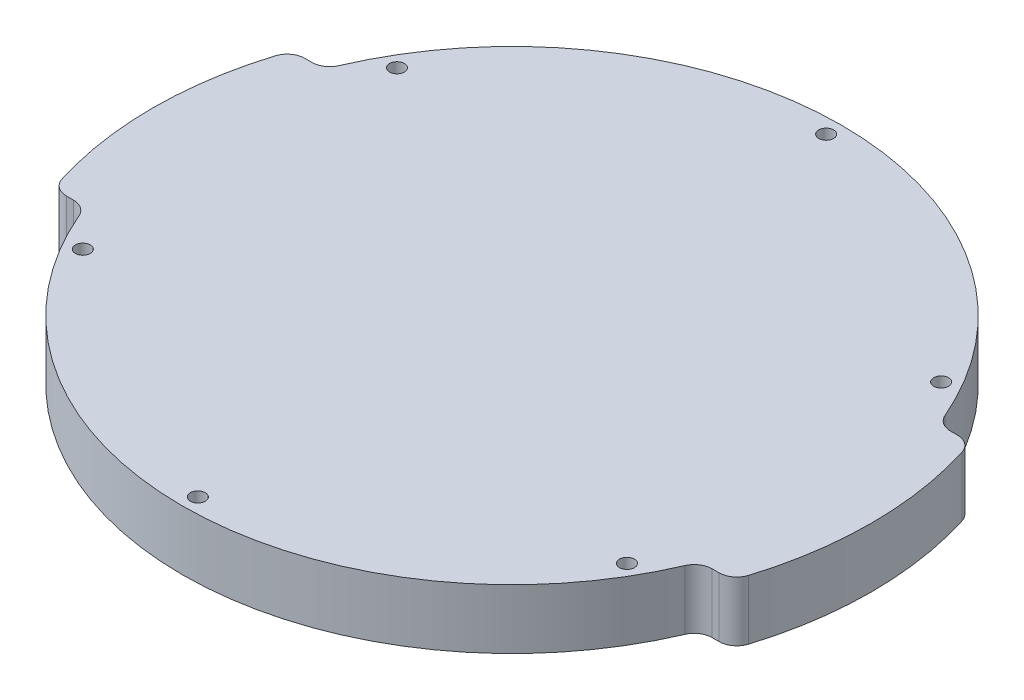
ISO-10303-21;
HEADER;
FILE_DESCRIPTION(('STEP AP214'),'2;1');
FILE_NAME('part.step','',(''),(''),'','','');
FILE_SCHEMA(('AUTOMOTIVE_DESIGN { 1 0 10303 214 1 1 1 1 }'));
ENDSEC;
DATA;
#1=APPLICATION_CONTEXT('core data for automotive mechanical design processes');
#2=APPLICATION_PROTOCOL_DEFINITION('international standard','automotive_design',2000,#1);
#3=PRODUCT_CONTEXT('',#1,'mechanical');
#4=PRODUCT('Part','Part','',(#3));
#5=PRODUCT_RELATED_PRODUCT_CATEGORY('part','',(#4));
#6=PRODUCT_DEFINITION_FORMATION('','',#4);
#7=PRODUCT_DEFINITION_CONTEXT('part definition',#1,'design');
#8=PRODUCT_DEFINITION('design','',#6,#7);
#9=PRODUCT_DEFINITION_SHAPE('','',#8);
#10=(LENGTH_UNIT() NAMED_UNIT(*) SI_UNIT(.MILLI.,.METRE.));
#11=(NAMED_UNIT(*) PLANE_ANGLE_UNIT() SI_UNIT($,.RADIAN.));
#12=(NAMED_UNIT(*) SI_UNIT($,.STERADIAN.) SOLID_ANGLE_UNIT());
#13=UNCERTAINTY_MEASURE_WITH_UNIT(LENGTH_MEASURE(1.E-05),#10,'distance_accuracy_value','');
#14=(GEOMETRIC_REPRESENTATION_CONTEXT(3) GLOBAL_UNCERTAINTY_ASSIGNED_CONTEXT((#13)) GLOBAL_UNIT_ASSIGNED_CONTEXT((#10,
#11,#12)) REPRESENTATION_CONTEXT('',''));
#15=CARTESIAN_POINT('',(0.,0.,0.));
#16=DIRECTION('',(0.,0.,1.));
#17=DIRECTION('',(1.,0.,0.));
#18=AXIS2_PLACEMENT_3D('',#15,#16,#17);
#19=CARTESIAN_POINT('',(0.,10.,0.));
#20=DIRECTION('',(0.,-1.,0.));
#21=DIRECTION('',(0.,0.,-1.));
#22=AXIS2_PLACEMENT_3D('',#19,#20,#21);
#23=CYLINDRICAL_SURFACE('',#22,60.3);
#24=CARTESIAN_POINT('',(0.,0.,0.));
#25=DIRECTION('',(0.,1.,0.));
#26=DIRECTION('',(0.,0.,1.));
#27=AXIS2_PLACEMENT_3D('',#24,#25,#26);
#28=CIRCLE('',#27,60.3);
#29=CARTESIAN_POINT('',(57.5850330094447,0.,17.8900523560209));
#30=VERTEX_POINT('',#29);
#31=CARTESIAN_POINT('',(57.5850330094447,0.,-17.8900523560209));
#32=VERTEX_POINT('',#31);
#33=EDGE_CURVE('E190',#30,#32,#28,.T.);
#34=ORIENTED_EDGE('',*,*,#33,.T.);
#35=DIRECTION('',(0.,-1.,0.));
#36=VECTOR('',#35,1.);
#37=CARTESIAN_POINT('',(57.5850330094447,10.,-17.8900523560209));
#38=LINE('',#37,#36);
#39=CARTESIAN_POINT('',(57.5850330094447,10.,-17.8900523560209));
#40=VERTEX_POINT('',#39);
#41=EDGE_CURVE('E197',#32,#40,#38,.F.);
#42=ORIENTED_EDGE('',*,*,#41,.T.);
#43=CARTESIAN_POINT('',(0.,10.,0.));
#44=DIRECTION('',(0.,1.,0.));
#45=DIRECTION('',(0.,0.,1.));
#46=AXIS2_PLACEMENT_3D('',#43,#44,#45);
#47=CIRCLE('',#46,60.3);
#48=CARTESIAN_POINT('',(57.5850330094447,10.,17.8900523560209));
#49=VERTEX_POINT('',#48);
#50=EDGE_CURVE('E186',#49,#40,#47,.T.);
#51=ORIENTED_EDGE('',*,*,#50,.F.);
#52=DIRECTION('',(0.,-1.,0.));
#53=VECTOR('',#52,1.);
#54=CARTESIAN_POINT('',(57.5850330094447,10.,17.8900523560209));
#55=LINE('',#54,#53);
#56=EDGE_CURVE('E195',#49,#30,#55,.T.);
#57=ORIENTED_EDGE('',*,*,#56,.T.);
#58=EDGE_LOOP('',(#34,#42,#51,#57));
#59=FACE_BOUND('',#58,.T.);
#60=ADVANCED_FACE('F33',(#59),#23,.T.);
#61=CARTESIAN_POINT('',(-57.5850330094447,0.,-17.8900523560209));
#62=VERTEX_POINT('',#61);
#63=CARTESIAN_POINT('',(-57.5850330094446,0.,17.890052356021));
#64=VERTEX_POINT('',#63);
#65=EDGE_CURVE('E187',#62,#64,#28,.T.);
#66=ORIENTED_EDGE('',*,*,#65,.T.);
#67=DIRECTION('',(0.,-1.,0.));
#68=VECTOR('',#67,1.);
#69=CARTESIAN_POINT('',(-57.5850330094447,10.,17.890052356021));
#70=LINE('',#69,#68);
#71=CARTESIAN_POINT('',(-57.5850330094446,10.,17.890052356021));
#72=VERTEX_POINT('',#71);
#73=EDGE_CURVE('E231',#64,#72,#70,.F.);
#74=ORIENTED_EDGE('',*,*,#73,.T.);
#75=CARTESIAN_POINT('',(-57.5850330094447,10.,-17.8900523560209));
#76=VERTEX_POINT('',#75);
#77=EDGE_CURVE('E183',#76,#72,#47,.T.);
#78=ORIENTED_EDGE('',*,*,#77,.F.);
#79=DIRECTION('',(0.,-1.,0.));
#80=VECTOR('',#79,1.);
#81=CARTESIAN_POINT('',(-57.5850330094447,10.,-17.8900523560209));
#82=LINE('',#81,#80);
#83=EDGE_CURVE('E229',#76,#62,#82,.T.);
#84=ORIENTED_EDGE('',*,*,#83,.T.);
#85=EDGE_LOOP('',(#66,#74,#78,#84));
#86=FACE_BOUND('',#85,.T.);
#87=ADVANCED_FACE('F285',(#86),#23,.T.);
#88=CARTESIAN_POINT('',(0.,10.,0.));
#89=DIRECTION('',(0.,1.,0.));
#90=DIRECTION('',(0.,0.,1.));
#91=AXIS2_PLACEMENT_3D('',#88,#89,#90);
#92=PLANE('',#91);
#93=CARTESIAN_POINT('',(45.6395387794396,10.,-26.3500000000005));
#94=DIRECTION('',(0.,-1.,0.));
#95=DIRECTION('',(0.,0.,-1.));
#96=AXIS2_PLACEMENT_3D('',#93,#94,#95);
#97=CIRCLE('',#96,1.25);
#98=CARTESIAN_POINT('',(45.6395387794396,10.,-27.6000000000005));
#99=VERTEX_POINT('',#98);
#100=EDGE_CURVE('E343',#99,#99,#97,.T.);
#101=ORIENTED_EDGE('',*,*,#100,.T.);
#102=EDGE_LOOP('',(#101));
#103=FACE_BOUND('',#102,.T.);
#104=CARTESIAN_POINT('',(45.6395387794402,10.,26.3499999999996));
#105=DIRECTION('',(0.,-1.,0.));
#106=DIRECTION('',(0.,0.,-1.));
#107=AXIS2_PLACEMENT_3D('',#104,#105,#106);
#108=CIRCLE('',#107,1.25);
#109=CARTESIAN_POINT('',(45.6395387794402,10.,25.0999999999996));
#110=VERTEX_POINT('',#109);
#111=EDGE_CURVE('E351',#110,#110,#108,.T.);
#112=ORIENTED_EDGE('',*,*,#111,.T.);
#113=EDGE_LOOP('',(#112));
#114=FACE_BOUND('',#113,.T.);
#115=CARTESIAN_POINT('',(3.68002133114066E-13,10.,52.7));
#116=DIRECTION('',(0.,-1.,0.));
#117=DIRECTION('',(0.,0.,-1.));
#118=AXIS2_PLACEMENT_3D('',#115,#116,#117);
#119=CIRCLE('',#118,1.25);
#120=CARTESIAN_POINT('',(3.68002133114066E-13,10.,51.45));
#121=VERTEX_POINT('',#120);
#122=EDGE_CURVE('E357',#121,#121,#119,.T.);
#123=ORIENTED_EDGE('',*,*,#122,.T.);
#124=EDGE_LOOP('',(#123));
#125=FACE_BOUND('',#124,.T.);
#126=CARTESIAN_POINT('',(-45.6395387794398,10.,26.3500000000002));
#127=DIRECTION('',(0.,-1.,0.));
#128=DIRECTION('',(0.,0.,-1.));
#129=AXIS2_PLACEMENT_3D('',#126,#127,#128);
#130=CIRCLE('',#129,1.25);
#131=CARTESIAN_POINT('',(-45.6395387794398,10.,25.1000000000002));
#132=VERTEX_POINT('',#131);
#133=EDGE_CURVE('E363',#132,#132,#130,.T.);
#134=ORIENTED_EDGE('',*,*,#133,.T.);
#135=EDGE_LOOP('',(#134));
#136=FACE_BOUND('',#135,.T.);
#137=CARTESIAN_POINT('',(-45.63953877944,10.,-26.3499999999999));
#138=DIRECTION('',(0.,-1.,0.));
#139=DIRECTION('',(0.,0.,-1.));
#140=AXIS2_PLACEMENT_3D('',#137,#138,#139);
#141=CIRCLE('',#140,1.25);
#142=CARTESIAN_POINT('',(-45.63953877944,10.,-27.5999999999999));
#143=VERTEX_POINT('',#142);
#144=EDGE_CURVE('E369',#143,#143,#141,.T.);
#145=ORIENTED_EDGE('',*,*,#144,.T.);
#146=EDGE_LOOP('',(#145));
#147=FACE_BOUND('',#146,.T.);
#148=CARTESIAN_POINT('',(0.,10.,-52.7));
#149=DIRECTION('',(0.,-1.,0.));
#150=DIRECTION('',(0.,0.,-1.));
#151=AXIS2_PLACEMENT_3D('',#148,#149,#150);
#152=CIRCLE('',#151,1.25);
#153=CARTESIAN_POINT('',(0.,10.,-53.95));
#154=VERTEX_POINT('',#153);
#155=EDGE_CURVE('E375',#154,#154,#152,.T.);
#156=ORIENTED_EDGE('',*,*,#155,.T.);
#157=EDGE_LOOP('',(#156));
#158=FACE_BOUND('',#157,.T.);
#159=ORIENTED_EDGE('',*,*,#50,.T.);
#160=CARTESIAN_POINT('',(54.7201059940494,10.,-17.));
#161=DIRECTION('',(0.,1.,0.));
#162=DIRECTION('',(0.,0.,1.));
#163=AXIS2_PLACEMENT_3D('',#160,#161,#162);
#164=CIRCLE('',#163,3.);
#165=CARTESIAN_POINT('',(54.7201059940494,10.,-20.));
#166=VERTEX_POINT('',#165);
#167=EDGE_CURVE('E173',#40,#166,#164,.T.);
#168=ORIENTED_EDGE('',*,*,#167,.T.);
#169=DIRECTION('',(1.,0.,0.));
#170=VECTOR('',#169,1.);
#171=CARTESIAN_POINT('',(51.5566678519859,10.,-20.));
#172=LINE('',#171,#170);
#173=CARTESIAN_POINT('',(53.5713542856628,10.,-20.));
#174=VERTEX_POINT('',#173);
#175=EDGE_CURVE('E164',#174,#166,#172,.T.);
#176=ORIENTED_EDGE('',*,*,#175,.F.);
#177=CARTESIAN_POINT('',(53.5713542856628,10.,-23.));
#178=DIRECTION('',(0.,1.,0.));
#179=DIRECTION('',(0.,0.,1.));
#180=AXIS2_PLACEMENT_3D('',#177,#178,#179);
#181=CIRCLE('',#180,3.);
#182=CARTESIAN_POINT('',(50.8146808232788,10.,-21.8164665523156));
#183=VERTEX_POINT('',#182);
#184=EDGE_CURVE('E147',#174,#183,#181,.F.);
#185=ORIENTED_EDGE('',*,*,#184,.T.);
#186=CARTESIAN_POINT('',(0.,10.,0.));
#187=DIRECTION('',(0.,-1.,0.));
#188=DIRECTION('',(0.,0.,1.));
#189=AXIS2_PLACEMENT_3D('',#186,#187,#188);
#190=CIRCLE('',#189,55.3);
#191=CARTESIAN_POINT('',(-50.8146808232788,10.,-21.8164665523156));
#192=VERTEX_POINT('',#191);
#193=EDGE_CURVE('E175',#192,#183,#190,.T.);
#194=ORIENTED_EDGE('',*,*,#193,.F.);
#195=CARTESIAN_POINT('',(-53.5713542856628,10.,-23.));
#196=DIRECTION('',(0.,1.,0.));
#197=DIRECTION('',(0.,0.,1.));
#198=AXIS2_PLACEMENT_3D('',#195,#196,#197);
#199=CIRCLE('',#198,3.);
#200=CARTESIAN_POINT('',(-53.5713542856628,10.,-20.));
#201=VERTEX_POINT('',#200);
#202=EDGE_CURVE('E41',#192,#201,#199,.F.);
#203=ORIENTED_EDGE('',*,*,#202,.T.);
#204=DIRECTION('',(1.,0.,0.));
#205=VECTOR('',#204,1.);
#206=CARTESIAN_POINT('',(-51.5566678519859,10.,-20.));
#207=LINE('',#206,#205);
#208=CARTESIAN_POINT('',(-54.7201059940494,10.,-20.));
#209=VERTEX_POINT('',#208);
#210=EDGE_CURVE('E174',#209,#201,#207,.T.);
#211=ORIENTED_EDGE('',*,*,#210,.F.);
#212=CARTESIAN_POINT('',(-54.7201059940494,10.,-17.));
#213=DIRECTION('',(0.,1.,0.));
#214=DIRECTION('',(0.,0.,1.));
#215=AXIS2_PLACEMENT_3D('',#212,#213,#214);
#216=CIRCLE('',#215,3.);
#217=EDGE_CURVE('E200',#209,#76,#216,.T.);
#218=ORIENTED_EDGE('',*,*,#217,.T.);
#219=ORIENTED_EDGE('',*,*,#77,.T.);
#220=CARTESIAN_POINT('',(-54.7201059940494,10.,17.));
#221=DIRECTION('',(0.,1.,0.));
#222=DIRECTION('',(0.,0.,1.));
#223=AXIS2_PLACEMENT_3D('',#220,#221,#222);
#224=CIRCLE('',#223,3.);
#225=CARTESIAN_POINT('',(-54.7201059940494,10.,20.));
#226=VERTEX_POINT('',#225);
#227=EDGE_CURVE('E202',#72,#226,#224,.T.);
#228=ORIENTED_EDGE('',*,*,#227,.T.);
#229=DIRECTION('',(-1.,0.,0.));
#230=VECTOR('',#229,1.);
#231=CARTESIAN_POINT('',(-56.8866416656846,10.,20.));
#232=LINE('',#231,#230);
#233=CARTESIAN_POINT('',(-53.5713542856628,10.,20.));
#234=VERTEX_POINT('',#233);
#235=EDGE_CURVE('E390',#234,#226,#232,.T.);
#236=ORIENTED_EDGE('',*,*,#235,.F.);
#237=CARTESIAN_POINT('',(-53.5713542856628,10.,23.));
#238=DIRECTION('',(0.,1.,0.));
#239=DIRECTION('',(0.,0.,1.));
#240=AXIS2_PLACEMENT_3D('',#237,#238,#239);
#241=CIRCLE('',#240,3.);
#242=CARTESIAN_POINT('',(-50.8146808232787,10.,21.8164665523156));
#243=VERTEX_POINT('',#242);
#244=EDGE_CURVE('E242',#234,#243,#241,.F.);
#245=ORIENTED_EDGE('',*,*,#244,.T.);
#246=CARTESIAN_POINT('',(0.,10.,0.));
#247=DIRECTION('',(0.,-1.,0.));
#248=DIRECTION('',(0.,0.,1.));
#249=AXIS2_PLACEMENT_3D('',#246,#247,#248);
#250=CIRCLE('',#249,55.3);
#251=CARTESIAN_POINT('',(50.8146808232787,10.,21.8164665523156));
#252=VERTEX_POINT('',#251);
#253=EDGE_CURVE('E378',#252,#243,#250,.T.);
#254=ORIENTED_EDGE('',*,*,#253,.F.);
#255=CARTESIAN_POINT('',(53.5713542856628,10.,23.));
#256=DIRECTION('',(0.,1.,0.));
#257=DIRECTION('',(0.,0.,1.));
#258=AXIS2_PLACEMENT_3D('',#255,#256,#257);
#259=CIRCLE('',#258,3.);
#260=CARTESIAN_POINT('',(53.5713542856628,10.,20.));
#261=VERTEX_POINT('',#260);
#262=EDGE_CURVE('E238',#252,#261,#259,.F.);
#263=ORIENTED_EDGE('',*,*,#262,.T.);
#264=DIRECTION('',(-1.,0.,0.));
#265=VECTOR('',#264,1.);
#266=CARTESIAN_POINT('',(51.5566678519859,10.,20.));
#267=LINE('',#266,#265);
#268=CARTESIAN_POINT('',(54.7201059940494,10.,20.));
#269=VERTEX_POINT('',#268);
#270=EDGE_CURVE('E260',#269,#261,#267,.T.);
#271=ORIENTED_EDGE('',*,*,#270,.F.);
#272=CARTESIAN_POINT('',(54.7201059940494,10.,17.));
#273=DIRECTION('',(0.,1.,0.));
#274=DIRECTION('',(0.,0.,1.));
#275=AXIS2_PLACEMENT_3D('',#272,#273,#274);
#276=CIRCLE('',#275,3.);
#277=EDGE_CURVE('E204',#269,#49,#276,.T.);
#278=ORIENTED_EDGE('',*,*,#277,.T.);
#279=EDGE_LOOP('',(#159,#168,#176,#185,#194,#203,#211,#218,#219,#228,#236,#245,#254,#263,#271,#278));
#280=FACE_BOUND('',#279,.T.);
#281=ADVANCED_FACE('F172',(#103,#114,#125,#136,#147,#158,#280),#92,.T.);
#282=CARTESIAN_POINT('',(0.,0.,0.));
#283=DIRECTION('',(0.,1.,0.));
#284=DIRECTION('',(0.,0.,1.));
#285=AXIS2_PLACEMENT_3D('',#282,#283,#284);
#286=PLANE('',#285);
#287=CARTESIAN_POINT('',(45.6395387794396,0.,-26.3500000000005));
#288=DIRECTION('',(0.,-1.,0.));
#289=DIRECTION('',(0.,0.,-1.));
#290=AXIS2_PLACEMENT_3D('',#287,#288,#289);
#291=CIRCLE('',#290,1.25);
#292=CARTESIAN_POINT('',(45.6395387794396,0.,-27.6000000000005));
#293=VERTEX_POINT('',#292);
#294=EDGE_CURVE('E346',#293,#293,#291,.T.);
#295=ORIENTED_EDGE('',*,*,#294,.F.);
#296=EDGE_LOOP('',(#295));
#297=FACE_BOUND('',#296,.T.);
#298=CARTESIAN_POINT('',(45.6395387794402,0.,26.3499999999996));
#299=DIRECTION('',(0.,-1.,0.));
#300=DIRECTION('',(0.,0.,-1.));
#301=AXIS2_PLACEMENT_3D('',#298,#299,#300);
#302=CIRCLE('',#301,1.25);
#303=CARTESIAN_POINT('',(45.6395387794402,0.,25.0999999999996));
#304=VERTEX_POINT('',#303);
#305=EDGE_CURVE('E348',#304,#304,#302,.T.);
#306=ORIENTED_EDGE('',*,*,#305,.F.);
#307=EDGE_LOOP('',(#306));
#308=FACE_BOUND('',#307,.T.);
#309=CARTESIAN_POINT('',(3.68002133114066E-13,0.,52.7));
#310=DIRECTION('',(0.,-1.,0.));
#311=DIRECTION('',(0.,0.,-1.));
#312=AXIS2_PLACEMENT_3D('',#309,#310,#311);
#313=CIRCLE('',#312,1.25);
#314=CARTESIAN_POINT('',(3.68002133114066E-13,0.,51.45));
#315=VERTEX_POINT('',#314);
#316=EDGE_CURVE('E354',#315,#315,#313,.T.);
#317=ORIENTED_EDGE('',*,*,#316,.F.);
#318=EDGE_LOOP('',(#317));
#319=FACE_BOUND('',#318,.T.);
#320=CARTESIAN_POINT('',(-45.6395387794398,0.,26.3500000000002));
#321=DIRECTION('',(0.,-1.,0.));
#322=DIRECTION('',(0.,0.,-1.));
#323=AXIS2_PLACEMENT_3D('',#320,#321,#322);
#324=CIRCLE('',#323,1.25);
#325=CARTESIAN_POINT('',(-45.6395387794398,0.,25.1000000000002));
#326=VERTEX_POINT('',#325);
#327=EDGE_CURVE('E360',#326,#326,#324,.T.);
#328=ORIENTED_EDGE('',*,*,#327,.F.);
#329=EDGE_LOOP('',(#328));
#330=FACE_BOUND('',#329,.T.);
#331=CARTESIAN_POINT('',(-45.63953877944,0.,-26.3499999999999));
#332=DIRECTION('',(0.,-1.,0.));
#333=DIRECTION('',(0.,0.,-1.));
#334=AXIS2_PLACEMENT_3D('',#331,#332,#333);
#335=CIRCLE('',#334,1.25);
#336=CARTESIAN_POINT('',(-45.63953877944,0.,-27.5999999999999));
#337=VERTEX_POINT('',#336);
#338=EDGE_CURVE('E366',#337,#337,#335,.T.);
#339=ORIENTED_EDGE('',*,*,#338,.F.);
#340=EDGE_LOOP('',(#339));
#341=FACE_BOUND('',#340,.T.);
#342=CARTESIAN_POINT('',(0.,0.,-52.7));
#343=DIRECTION('',(0.,-1.,0.));
#344=DIRECTION('',(0.,0.,-1.));
#345=AXIS2_PLACEMENT_3D('',#342,#343,#344);
#346=CIRCLE('',#345,1.25);
#347=CARTESIAN_POINT('',(0.,0.,-53.95));
#348=VERTEX_POINT('',#347);
#349=EDGE_CURVE('E372',#348,#348,#346,.T.);
#350=ORIENTED_EDGE('',*,*,#349,.F.);
#351=EDGE_LOOP('',(#350));
#352=FACE_BOUND('',#351,.T.);
#353=DIRECTION('',(1.,0.,0.));
#354=VECTOR('',#353,1.);
#355=CARTESIAN_POINT('',(51.5566678519859,0.,-20.));
#356=LINE('',#355,#354);
#357=CARTESIAN_POINT('',(53.5713542856628,0.,-20.));
#358=VERTEX_POINT('',#357);
#359=CARTESIAN_POINT('',(54.7201059940494,0.,-20.));
#360=VERTEX_POINT('',#359);
#361=EDGE_CURVE('E167',#358,#360,#356,.T.);
#362=ORIENTED_EDGE('',*,*,#361,.T.);
#363=CARTESIAN_POINT('',(54.7201059940494,0.,-17.));
#364=DIRECTION('',(0.,1.,0.));
#365=DIRECTION('',(0.,0.,1.));
#366=AXIS2_PLACEMENT_3D('',#363,#364,#365);
#367=CIRCLE('',#366,3.);
#368=EDGE_CURVE('E212',#360,#32,#367,.F.);
#369=ORIENTED_EDGE('',*,*,#368,.T.);
#370=ORIENTED_EDGE('',*,*,#33,.F.);
#371=CARTESIAN_POINT('',(54.7201059940494,0.,17.));
#372=DIRECTION('',(0.,1.,0.));
#373=DIRECTION('',(0.,0.,1.));
#374=AXIS2_PLACEMENT_3D('',#371,#372,#373);
#375=CIRCLE('',#374,3.);
#376=CARTESIAN_POINT('',(54.7201059940494,0.,20.));
#377=VERTEX_POINT('',#376);
#378=EDGE_CURVE('E210',#30,#377,#375,.F.);
#379=ORIENTED_EDGE('',*,*,#378,.T.);
#380=DIRECTION('',(-1.,0.,0.));
#381=VECTOR('',#380,1.);
#382=CARTESIAN_POINT('',(51.5566678519859,0.,20.));
#383=LINE('',#382,#381);
#384=CARTESIAN_POINT('',(53.5713542856628,0.,20.));
#385=VERTEX_POINT('',#384);
#386=EDGE_CURVE('E179',#377,#385,#383,.T.);
#387=ORIENTED_EDGE('',*,*,#386,.T.);
#388=CARTESIAN_POINT('',(53.5713542856628,0.,23.));
#389=DIRECTION('',(0.,1.,0.));
#390=DIRECTION('',(0.,0.,1.));
#391=AXIS2_PLACEMENT_3D('',#388,#389,#390);
#392=CIRCLE('',#391,3.);
#393=CARTESIAN_POINT('',(50.8146808232787,0.,21.8164665523156));
#394=VERTEX_POINT('',#393);
#395=EDGE_CURVE('E240',#385,#394,#392,.T.);
#396=ORIENTED_EDGE('',*,*,#395,.T.);
#397=CARTESIAN_POINT('',(0.,0.,0.));
#398=DIRECTION('',(0.,-1.,0.));
#399=DIRECTION('',(0.,0.,1.));
#400=AXIS2_PLACEMENT_3D('',#397,#398,#399);
#401=CIRCLE('',#400,55.3);
#402=CARTESIAN_POINT('',(-50.8146808232787,0.,21.8164665523156));
#403=VERTEX_POINT('',#402);
#404=EDGE_CURVE('E381',#394,#403,#401,.T.);
#405=ORIENTED_EDGE('',*,*,#404,.T.);
#406=CARTESIAN_POINT('',(-53.5713542856628,0.,23.));
#407=DIRECTION('',(0.,1.,0.));
#408=DIRECTION('',(0.,0.,1.));
#409=AXIS2_PLACEMENT_3D('',#406,#407,#408);
#410=CIRCLE('',#409,3.);
#411=CARTESIAN_POINT('',(-53.5713542856628,0.,20.));
#412=VERTEX_POINT('',#411);
#413=EDGE_CURVE('E244',#403,#412,#410,.T.);
#414=ORIENTED_EDGE('',*,*,#413,.T.);
#415=DIRECTION('',(-1.,0.,0.));
#416=VECTOR('',#415,1.);
#417=CARTESIAN_POINT('',(-56.8866416656846,0.,20.));
#418=LINE('',#417,#416);
#419=CARTESIAN_POINT('',(-54.7201059940494,0.,20.));
#420=VERTEX_POINT('',#419);
#421=EDGE_CURVE('E384',#412,#420,#418,.T.);
#422=ORIENTED_EDGE('',*,*,#421,.T.);
#423=CARTESIAN_POINT('',(-54.7201059940494,0.,17.));
#424=DIRECTION('',(0.,1.,0.));
#425=DIRECTION('',(0.,0.,1.));
#426=AXIS2_PLACEMENT_3D('',#423,#424,#425);
#427=CIRCLE('',#426,3.);
#428=EDGE_CURVE('E208',#420,#64,#427,.F.);
#429=ORIENTED_EDGE('',*,*,#428,.T.);
#430=ORIENTED_EDGE('',*,*,#65,.F.);
#431=CARTESIAN_POINT('',(-54.7201059940494,0.,-17.));
#432=DIRECTION('',(0.,1.,0.));
#433=DIRECTION('',(0.,0.,1.));
#434=AXIS2_PLACEMENT_3D('',#431,#432,#433);
#435=CIRCLE('',#434,3.);
#436=CARTESIAN_POINT('',(-54.7201059940494,0.,-20.));
#437=VERTEX_POINT('',#436);
#438=EDGE_CURVE('E55',#62,#437,#435,.F.);
#439=ORIENTED_EDGE('',*,*,#438,.T.);
#440=DIRECTION('',(1.,0.,0.));
#441=VECTOR('',#440,1.);
#442=CARTESIAN_POINT('',(-51.5566678519859,0.,-20.));
#443=LINE('',#442,#441);
#444=CARTESIAN_POINT('',(-53.5713542856628,0.,-20.));
#445=VERTEX_POINT('',#444);
#446=EDGE_CURVE('E254',#437,#445,#443,.T.);
#447=ORIENTED_EDGE('',*,*,#446,.T.);
#448=CARTESIAN_POINT('',(-53.5713542856628,0.,-23.));
#449=DIRECTION('',(0.,1.,0.));
#450=DIRECTION('',(0.,0.,1.));
#451=AXIS2_PLACEMENT_3D('',#448,#449,#450);
#452=CIRCLE('',#451,3.);
#453=CARTESIAN_POINT('',(-50.8146808232788,0.,-21.8164665523156));
#454=VERTEX_POINT('',#453);
#455=EDGE_CURVE('E11',#445,#454,#452,.T.);
#456=ORIENTED_EDGE('',*,*,#455,.T.);
#457=CARTESIAN_POINT('',(0.,0.,0.));
#458=DIRECTION('',(0.,-1.,0.));
#459=DIRECTION('',(0.,0.,1.));
#460=AXIS2_PLACEMENT_3D('',#457,#458,#459);
#461=CIRCLE('',#460,55.3);
#462=CARTESIAN_POINT('',(50.8146808232788,0.,-21.8164665523156));
#463=VERTEX_POINT('',#462);
#464=EDGE_CURVE('E177',#454,#463,#461,.T.);
#465=ORIENTED_EDGE('',*,*,#464,.T.);
#466=CARTESIAN_POINT('',(53.5713542856628,0.,-23.));
#467=DIRECTION('',(0.,1.,0.));
#468=DIRECTION('',(0.,0.,1.));
#469=AXIS2_PLACEMENT_3D('',#466,#467,#468);
#470=CIRCLE('',#469,3.);
#471=EDGE_CURVE('E157',#463,#358,#470,.T.);
#472=ORIENTED_EDGE('',*,*,#471,.T.);
#473=EDGE_LOOP('',(#362,#369,#370,#379,#387,#396,#405,#414,#422,#429,#430,#439,#447,#456,#465,#472));
#474=FACE_BOUND('',#473,.T.);
#475=ADVANCED_FACE('F253',(#297,#308,#319,#330,#341,#352,#474),#286,.F.);
#476=CARTESIAN_POINT('',(0.,0.,0.));
#477=DIRECTION('',(0.,1.,0.));
#478=DIRECTION('',(0.,0.,1.));
#479=AXIS2_PLACEMENT_3D('',#476,#477,#478);
#480=CYLINDRICAL_SURFACE('',#479,55.3);
#481=ORIENTED_EDGE('',*,*,#193,.T.);
#482=DIRECTION('',(0.,1.,0.));
#483=VECTOR('',#482,1.);
#484=CARTESIAN_POINT('',(50.8146808232788,0.,-21.8164665523156));
#485=LINE('',#484,#483);
#486=EDGE_CURVE('E152',#183,#463,#485,.F.);
#487=ORIENTED_EDGE('',*,*,#486,.T.);
#488=ORIENTED_EDGE('',*,*,#464,.F.);
#489=DIRECTION('',(0.,1.,0.));
#490=VECTOR('',#489,1.);
#491=CARTESIAN_POINT('',(-50.8146808232788,0.,-21.8164665523156));
#492=LINE('',#491,#490);
#493=EDGE_CURVE('E168',#454,#192,#492,.T.);
#494=ORIENTED_EDGE('',*,*,#493,.T.);
#495=EDGE_LOOP('',(#481,#487,#488,#494));
#496=FACE_BOUND('',#495,.T.);
#497=ADVANCED_FACE('F256',(#496),#480,.T.);
#498=CARTESIAN_POINT('',(-51.5566678519859,0.,-20.));
#499=DIRECTION('',(0.,0.,1.));
#500=DIRECTION('',(1.,0.,0.));
#501=AXIS2_PLACEMENT_3D('',#498,#499,#500);
#502=PLANE('',#501);
#503=ORIENTED_EDGE('',*,*,#446,.F.);
#504=DIRECTION('',(0.,-1.,0.));
#505=VECTOR('',#504,1.);
#506=CARTESIAN_POINT('',(-54.7201059940494,0.,-20.));
#507=LINE('',#506,#505);
#508=EDGE_CURVE('E158',#437,#209,#507,.F.);
#509=ORIENTED_EDGE('',*,*,#508,.T.);
#510=ORIENTED_EDGE('',*,*,#210,.T.);
#511=DIRECTION('',(0.,-1.,0.));
#512=VECTOR('',#511,1.);
#513=CARTESIAN_POINT('',(-53.5713542856628,0.,-20.));
#514=LINE('',#513,#512);
#515=EDGE_CURVE('E48',#201,#445,#514,.T.);
#516=ORIENTED_EDGE('',*,*,#515,.T.);
#517=EDGE_LOOP('',(#503,#509,#510,#516));
#518=FACE_BOUND('',#517,.T.);
#519=ADVANCED_FACE('F248',(#518),#502,.F.);
#520=CARTESIAN_POINT('',(51.5566678519859,0.,-20.));
#521=DIRECTION('',(0.,0.,1.));
#522=DIRECTION('',(1.,0.,0.));
#523=AXIS2_PLACEMENT_3D('',#520,#521,#522);
#524=PLANE('',#523);
#525=ORIENTED_EDGE('',*,*,#361,.F.);
#526=DIRECTION('',(0.,-1.,0.));
#527=VECTOR('',#526,1.);
#528=CARTESIAN_POINT('',(53.5713542856628,10.,-20.));
#529=LINE('',#528,#527);
#530=EDGE_CURVE('E151',#358,#174,#529,.F.);
#531=ORIENTED_EDGE('',*,*,#530,.T.);
#532=ORIENTED_EDGE('',*,*,#175,.T.);
#533=DIRECTION('',(0.,-1.,0.));
#534=VECTOR('',#533,1.);
#535=CARTESIAN_POINT('',(54.7201059940494,0.,-20.));
#536=LINE('',#535,#534);
#537=EDGE_CURVE('E169',#166,#360,#536,.T.);
#538=ORIENTED_EDGE('',*,*,#537,.T.);
#539=EDGE_LOOP('',(#525,#531,#532,#538));
#540=FACE_BOUND('',#539,.T.);
#541=ADVANCED_FACE('F163',(#540),#524,.F.);
#542=CARTESIAN_POINT('',(0.,0.,0.));
#543=DIRECTION('',(0.,1.,0.));
#544=DIRECTION('',(0.,0.,1.));
#545=AXIS2_PLACEMENT_3D('',#542,#543,#544);
#546=CYLINDRICAL_SURFACE('',#545,55.3);
#547=ORIENTED_EDGE('',*,*,#404,.F.);
#548=DIRECTION('',(0.,1.,0.));
#549=VECTOR('',#548,1.);
#550=CARTESIAN_POINT('',(50.8146808232787,0.,21.8164665523156));
#551=LINE('',#550,#549);
#552=EDGE_CURVE('E221',#394,#252,#551,.T.);
#553=ORIENTED_EDGE('',*,*,#552,.T.);
#554=ORIENTED_EDGE('',*,*,#253,.T.);
#555=DIRECTION('',(0.,1.,0.));
#556=VECTOR('',#555,1.);
#557=CARTESIAN_POINT('',(-50.8146808232787,0.,21.8164665523156));
#558=LINE('',#557,#556);
#559=EDGE_CURVE('E219',#243,#403,#558,.F.);
#560=ORIENTED_EDGE('',*,*,#559,.T.);
#561=EDGE_LOOP('',(#547,#553,#554,#560));
#562=FACE_BOUND('',#561,.T.);
#563=ADVANCED_FACE('F302',(#562),#546,.T.);
#564=CARTESIAN_POINT('',(51.5566678519859,0.,20.));
#565=DIRECTION('',(0.,0.,-1.));
#566=DIRECTION('',(-1.,0.,0.));
#567=AXIS2_PLACEMENT_3D('',#564,#565,#566);
#568=PLANE('',#567);
#569=ORIENTED_EDGE('',*,*,#386,.F.);
#570=DIRECTION('',(0.,-1.,0.));
#571=VECTOR('',#570,1.);
#572=CARTESIAN_POINT('',(54.7201059940494,0.,20.));
#573=LINE('',#572,#571);
#574=EDGE_CURVE('E216',#377,#269,#573,.F.);
#575=ORIENTED_EDGE('',*,*,#574,.T.);
#576=ORIENTED_EDGE('',*,*,#270,.T.);
#577=DIRECTION('',(0.,-1.,0.));
#578=VECTOR('',#577,1.);
#579=CARTESIAN_POINT('',(53.5713542856628,0.,20.));
#580=LINE('',#579,#578);
#581=EDGE_CURVE('E214',#261,#385,#580,.T.);
#582=ORIENTED_EDGE('',*,*,#581,.T.);
#583=EDGE_LOOP('',(#569,#575,#576,#582));
#584=FACE_BOUND('',#583,.T.);
#585=ADVANCED_FACE('F307',(#584),#568,.F.);
#586=CARTESIAN_POINT('',(-56.8866416656846,0.,20.));
#587=DIRECTION('',(0.,0.,-1.));
#588=DIRECTION('',(-1.,0.,0.));
#589=AXIS2_PLACEMENT_3D('',#586,#587,#588);
#590=PLANE('',#589);
#591=ORIENTED_EDGE('',*,*,#421,.F.);
#592=DIRECTION('',(0.,-1.,0.));
#593=VECTOR('',#592,1.);
#594=CARTESIAN_POINT('',(-53.5713542856628,10.,20.));
#595=LINE('',#594,#593);
#596=EDGE_CURVE('E226',#412,#234,#595,.F.);
#597=ORIENTED_EDGE('',*,*,#596,.T.);
#598=ORIENTED_EDGE('',*,*,#235,.T.);
#599=DIRECTION('',(0.,-1.,0.));
#600=VECTOR('',#599,1.);
#601=CARTESIAN_POINT('',(-54.7201059940494,0.,20.));
#602=LINE('',#601,#600);
#603=EDGE_CURVE('E224',#226,#420,#602,.T.);
#604=ORIENTED_EDGE('',*,*,#603,.T.);
#605=EDGE_LOOP('',(#591,#597,#598,#604));
#606=FACE_BOUND('',#605,.T.);
#607=ADVANCED_FACE('F282',(#606),#590,.F.);
#608=CARTESIAN_POINT('',(53.5713542856628,0.,-23.));
#609=DIRECTION('',(0.,1.,0.));
#610=DIRECTION('',(0.,0.,1.));
#611=AXIS2_PLACEMENT_3D('',#608,#609,#610);
#612=CYLINDRICAL_SURFACE('',#611,3.);
#613=ORIENTED_EDGE('',*,*,#471,.F.);
#614=ORIENTED_EDGE('',*,*,#486,.F.);
#615=ORIENTED_EDGE('',*,*,#184,.F.);
#616=ORIENTED_EDGE('',*,*,#530,.F.);
#617=EDGE_LOOP('',(#613,#614,#615,#616));
#618=FACE_BOUND('',#617,.T.);
#619=ADVANCED_FACE('F150',(#618),#612,.F.);
#620=CARTESIAN_POINT('',(54.7201059940494,10.,-17.));
#621=DIRECTION('',(0.,-1.,0.));
#622=DIRECTION('',(0.,0.,-1.));
#623=AXIS2_PLACEMENT_3D('',#620,#621,#622);
#624=CYLINDRICAL_SURFACE('',#623,3.);
#625=ORIENTED_EDGE('',*,*,#368,.F.);
#626=ORIENTED_EDGE('',*,*,#537,.F.);
#627=ORIENTED_EDGE('',*,*,#167,.F.);
#628=ORIENTED_EDGE('',*,*,#41,.F.);
#629=EDGE_LOOP('',(#625,#626,#627,#628));
#630=FACE_BOUND('',#629,.T.);
#631=ADVANCED_FACE('F271',(#630),#624,.T.);
#632=CARTESIAN_POINT('',(54.7201059940494,10.,17.));
#633=DIRECTION('',(0.,-1.,0.));
#634=DIRECTION('',(0.,0.,-1.));
#635=AXIS2_PLACEMENT_3D('',#632,#633,#634);
#636=CYLINDRICAL_SURFACE('',#635,3.);
#637=ORIENTED_EDGE('',*,*,#378,.F.);
#638=ORIENTED_EDGE('',*,*,#56,.F.);
#639=ORIENTED_EDGE('',*,*,#277,.F.);
#640=ORIENTED_EDGE('',*,*,#574,.F.);
#641=EDGE_LOOP('',(#637,#638,#639,#640));
#642=FACE_BOUND('',#641,.T.);
#643=ADVANCED_FACE('F273',(#642),#636,.T.);
#644=CARTESIAN_POINT('',(53.5713542856628,0.,23.));
#645=DIRECTION('',(0.,1.,0.));
#646=DIRECTION('',(0.,0.,1.));
#647=AXIS2_PLACEMENT_3D('',#644,#645,#646);
#648=CYLINDRICAL_SURFACE('',#647,3.);
#649=ORIENTED_EDGE('',*,*,#395,.F.);
#650=ORIENTED_EDGE('',*,*,#581,.F.);
#651=ORIENTED_EDGE('',*,*,#262,.F.);
#652=ORIENTED_EDGE('',*,*,#552,.F.);
#653=EDGE_LOOP('',(#649,#650,#651,#652));
#654=FACE_BOUND('',#653,.T.);
#655=ADVANCED_FACE('F279',(#654),#648,.F.);
#656=CARTESIAN_POINT('',(-53.5713542856628,0.,23.));
#657=DIRECTION('',(0.,1.,0.));
#658=DIRECTION('',(0.,0.,1.));
#659=AXIS2_PLACEMENT_3D('',#656,#657,#658);
#660=CYLINDRICAL_SURFACE('',#659,3.);
#661=ORIENTED_EDGE('',*,*,#413,.F.);
#662=ORIENTED_EDGE('',*,*,#559,.F.);
#663=ORIENTED_EDGE('',*,*,#244,.F.);
#664=ORIENTED_EDGE('',*,*,#596,.F.);
#665=EDGE_LOOP('',(#661,#662,#663,#664));
#666=FACE_BOUND('',#665,.T.);
#667=ADVANCED_FACE('F407',(#666),#660,.F.);
#668=CARTESIAN_POINT('',(-54.7201059940494,10.,17.));
#669=DIRECTION('',(0.,-1.,0.));
#670=DIRECTION('',(0.,0.,-1.));
#671=AXIS2_PLACEMENT_3D('',#668,#669,#670);
#672=CYLINDRICAL_SURFACE('',#671,3.);
#673=ORIENTED_EDGE('',*,*,#428,.F.);
#674=ORIENTED_EDGE('',*,*,#603,.F.);
#675=ORIENTED_EDGE('',*,*,#227,.F.);
#676=ORIENTED_EDGE('',*,*,#73,.F.);
#677=EDGE_LOOP('',(#673,#674,#675,#676));
#678=FACE_BOUND('',#677,.T.);
#679=ADVANCED_FACE('F412',(#678),#672,.T.);
#680=CARTESIAN_POINT('',(-54.7201059940494,10.,-17.));
#681=DIRECTION('',(0.,-1.,0.));
#682=DIRECTION('',(0.,0.,-1.));
#683=AXIS2_PLACEMENT_3D('',#680,#681,#682);
#684=CYLINDRICAL_SURFACE('',#683,3.);
#685=ORIENTED_EDGE('',*,*,#438,.F.);
#686=ORIENTED_EDGE('',*,*,#83,.F.);
#687=ORIENTED_EDGE('',*,*,#217,.F.);
#688=ORIENTED_EDGE('',*,*,#508,.F.);
#689=EDGE_LOOP('',(#685,#686,#687,#688));
#690=FACE_BOUND('',#689,.T.);
#691=ADVANCED_FACE('F417',(#690),#684,.T.);
#692=CARTESIAN_POINT('',(-53.5713542856628,0.,-23.));
#693=DIRECTION('',(0.,1.,0.));
#694=DIRECTION('',(0.,0.,1.));
#695=AXIS2_PLACEMENT_3D('',#692,#693,#694);
#696=CYLINDRICAL_SURFACE('',#695,3.);
#697=ORIENTED_EDGE('',*,*,#455,.F.);
#698=ORIENTED_EDGE('',*,*,#515,.F.);
#699=ORIENTED_EDGE('',*,*,#202,.F.);
#700=ORIENTED_EDGE('',*,*,#493,.F.);
#701=EDGE_LOOP('',(#697,#698,#699,#700));
#702=FACE_BOUND('',#701,.T.);
#703=ADVANCED_FACE('F35',(#702),#696,.F.);
#704=CARTESIAN_POINT('',(0.,10.,-52.7));
#705=DIRECTION('',(0.,-1.,0.));
#706=DIRECTION('',(0.,0.,-1.));
#707=AXIS2_PLACEMENT_3D('',#704,#705,#706);
#708=CYLINDRICAL_SURFACE('',#707,1.25);
#709=ORIENTED_EDGE('',*,*,#155,.F.);
#710=EDGE_LOOP('',(#709));
#711=FACE_BOUND('',#710,.T.);
#712=ORIENTED_EDGE('',*,*,#349,.T.);
#713=EDGE_LOOP('',(#712));
#714=FACE_BOUND('',#713,.T.);
#715=ADVANCED_FACE('F315',(#711,#714),#708,.F.);
#716=CARTESIAN_POINT('',(-45.63953877944,10.,-26.3499999999999));
#717=DIRECTION('',(0.,-1.,0.));
#718=DIRECTION('',(0.,0.,-1.));
#719=AXIS2_PLACEMENT_3D('',#716,#717,#718);
#720=CYLINDRICAL_SURFACE('',#719,1.25);
#721=ORIENTED_EDGE('',*,*,#144,.F.);
#722=EDGE_LOOP('',(#721));
#723=FACE_BOUND('',#722,.T.);
#724=ORIENTED_EDGE('',*,*,#338,.T.);
#725=EDGE_LOOP('',(#724));
#726=FACE_BOUND('',#725,.T.);
#727=ADVANCED_FACE('F318',(#723,#726),#720,.F.);
#728=CARTESIAN_POINT('',(-45.6395387794398,10.,26.3500000000002));
#729=DIRECTION('',(0.,-1.,0.));
#730=DIRECTION('',(0.,0.,-1.));
#731=AXIS2_PLACEMENT_3D('',#728,#729,#730);
#732=CYLINDRICAL_SURFACE('',#731,1.25);
#733=ORIENTED_EDGE('',*,*,#133,.F.);
#734=EDGE_LOOP('',(#733));
#735=FACE_BOUND('',#734,.T.);
#736=ORIENTED_EDGE('',*,*,#327,.T.);
#737=EDGE_LOOP('',(#736));
#738=FACE_BOUND('',#737,.T.);
#739=ADVANCED_FACE('F322',(#735,#738),#732,.F.);
#740=CARTESIAN_POINT('',(3.68002133114066E-13,10.,52.7));
#741=DIRECTION('',(0.,-1.,0.));
#742=DIRECTION('',(0.,0.,-1.));
#743=AXIS2_PLACEMENT_3D('',#740,#741,#742);
#744=CYLINDRICAL_SURFACE('',#743,1.25);
#745=ORIENTED_EDGE('',*,*,#122,.F.);
#746=EDGE_LOOP('',(#745));
#747=FACE_BOUND('',#746,.T.);
#748=ORIENTED_EDGE('',*,*,#316,.T.);
#749=EDGE_LOOP('',(#748));
#750=FACE_BOUND('',#749,.T.);
#751=ADVANCED_FACE('F326',(#747,#750),#744,.F.);
#752=CARTESIAN_POINT('',(45.6395387794402,10.,26.3499999999996));
#753=DIRECTION('',(0.,-1.,0.));
#754=DIRECTION('',(0.,0.,-1.));
#755=AXIS2_PLACEMENT_3D('',#752,#753,#754);
#756=CYLINDRICAL_SURFACE('',#755,1.25);
#757=ORIENTED_EDGE('',*,*,#111,.F.);
#758=EDGE_LOOP('',(#757));
#759=FACE_BOUND('',#758,.T.);
#760=ORIENTED_EDGE('',*,*,#305,.T.);
#761=EDGE_LOOP('',(#760));
#762=FACE_BOUND('',#761,.T.);
#763=ADVANCED_FACE('F330',(#759,#762),#756,.F.);
#764=CARTESIAN_POINT('',(45.6395387794396,10.,-26.3500000000005));
#765=DIRECTION('',(0.,-1.,0.));
#766=DIRECTION('',(0.,0.,-1.));
#767=AXIS2_PLACEMENT_3D('',#764,#765,#766);
#768=CYLINDRICAL_SURFACE('',#767,1.25);
#769=ORIENTED_EDGE('',*,*,#100,.F.);
#770=EDGE_LOOP('',(#769));
#771=FACE_BOUND('',#770,.T.);
#772=ORIENTED_EDGE('',*,*,#294,.T.);
#773=EDGE_LOOP('',(#772));
#774=FACE_BOUND('',#773,.T.);
#775=ADVANCED_FACE('F334',(#771,#774),#768,.F.);
#776=CLOSED_SHELL('',(#60,#87,#281,#475,#497,#519,#541,#563,#585,#607,#619,#631,#643,#655,#667,
#679,#691,#703,#715,#727,#739,#751,#763,#775));
#777=MANIFOLD_SOLID_BREP('B2',#776);
#778=ADVANCED_BREP_SHAPE_REPRESENTATION('',(#18,#777),#14);
#779=SHAPE_DEFINITION_REPRESENTATION(#9,#778);
ENDSEC;
END-ISO-10303-21;
